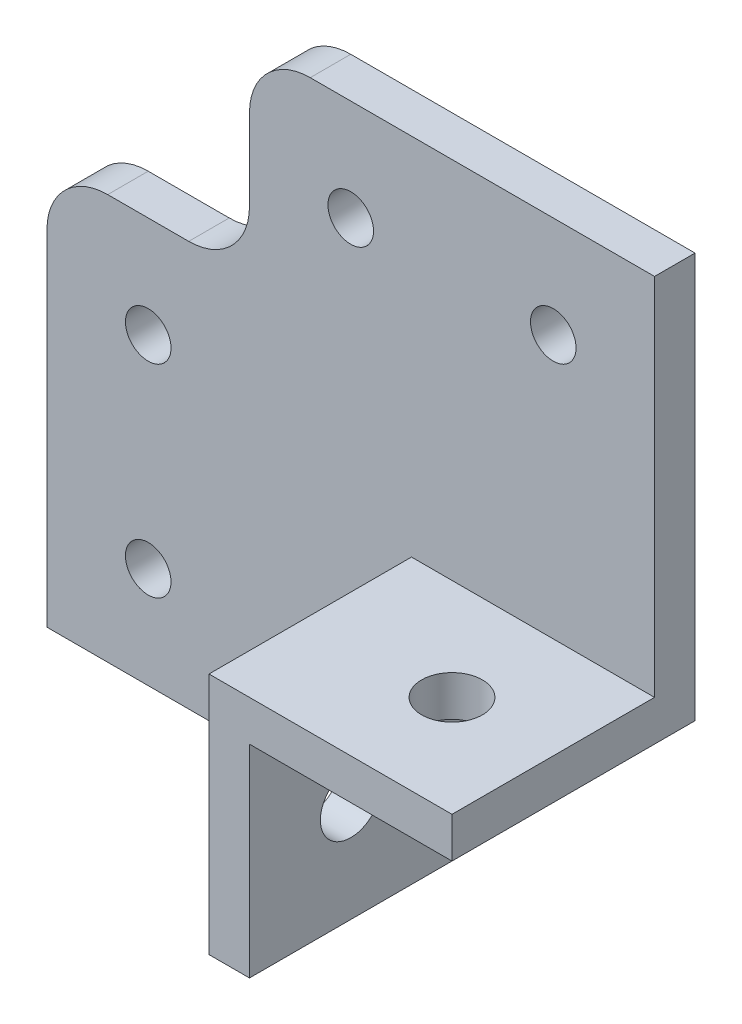
ISO-10303-21;
HEADER;
FILE_DESCRIPTION(('STEP AP214'),'2;1');
FILE_NAME('part.step','',(''),(''),'','','');
FILE_SCHEMA(('AUTOMOTIVE_DESIGN { 1 0 10303 214 1 1 1 1 }'));
ENDSEC;
DATA;
#1=APPLICATION_CONTEXT('core data for automotive mechanical design processes');
#2=APPLICATION_PROTOCOL_DEFINITION('international standard','automotive_design',2000,#1);
#3=PRODUCT_CONTEXT('',#1,'mechanical');
#4=PRODUCT('Part','Part','',(#3));
#5=PRODUCT_RELATED_PRODUCT_CATEGORY('part','',(#4));
#6=PRODUCT_DEFINITION_FORMATION('','',#4);
#7=PRODUCT_DEFINITION_CONTEXT('part definition',#1,'design');
#8=PRODUCT_DEFINITION('design','',#6,#7);
#9=PRODUCT_DEFINITION_SHAPE('','',#8);
#10=(LENGTH_UNIT() NAMED_UNIT(*) SI_UNIT(.MILLI.,.METRE.));
#11=(NAMED_UNIT(*) PLANE_ANGLE_UNIT() SI_UNIT($,.RADIAN.));
#12=(NAMED_UNIT(*) SI_UNIT($,.STERADIAN.) SOLID_ANGLE_UNIT());
#13=UNCERTAINTY_MEASURE_WITH_UNIT(LENGTH_MEASURE(1.E-05),#10,'distance_accuracy_value','');
#14=(GEOMETRIC_REPRESENTATION_CONTEXT(3) GLOBAL_UNCERTAINTY_ASSIGNED_CONTEXT((#13)) GLOBAL_UNIT_ASSIGNED_CONTEXT((#10,
#11,#12)) REPRESENTATION_CONTEXT('',''));
#15=CARTESIAN_POINT('',(0.,0.,0.));
#16=DIRECTION('',(0.,0.,1.));
#17=DIRECTION('',(1.,0.,0.));
#18=AXIS2_PLACEMENT_3D('',#15,#16,#17);
#19=CARTESIAN_POINT('',(20.,60.,4.));
#20=DIRECTION('',(0.,-1.,0.));
#21=DIRECTION('',(1.,0.,0.));
#22=AXIS2_PLACEMENT_3D('',#19,#20,#21);
#23=PLANE('',#22);
#24=DIRECTION('',(-1.,0.,0.));
#25=VECTOR('',#24,1.);
#26=CARTESIAN_POINT('',(20.,60.,0.));
#27=LINE('',#26,#25);
#28=CARTESIAN_POINT('',(20.,60.,0.));
#29=VERTEX_POINT('',#28);
#30=CARTESIAN_POINT('',(-14.,60.,0.));
#31=VERTEX_POINT('',#30);
#32=EDGE_CURVE('E229',#29,#31,#27,.T.);
#33=ORIENTED_EDGE('',*,*,#32,.T.);
#34=DIRECTION('',(0.,0.,-1.));
#35=VECTOR('',#34,1.);
#36=CARTESIAN_POINT('',(-14.,60.,4.));
#37=LINE('',#36,#35);
#38=CARTESIAN_POINT('',(-14.,60.,4.));
#39=VERTEX_POINT('',#38);
#40=EDGE_CURVE('E56',#31,#39,#37,.F.);
#41=ORIENTED_EDGE('',*,*,#40,.T.);
#42=DIRECTION('',(-1.,0.,0.));
#43=VECTOR('',#42,1.);
#44=CARTESIAN_POINT('',(20.,60.,4.));
#45=LINE('',#44,#43);
#46=CARTESIAN_POINT('',(20.,60.,4.));
#47=VERTEX_POINT('',#46);
#48=EDGE_CURVE('E244',#47,#39,#45,.T.);
#49=ORIENTED_EDGE('',*,*,#48,.F.);
#50=DIRECTION('',(0.,0.,-1.));
#51=VECTOR('',#50,1.);
#52=CARTESIAN_POINT('',(20.,60.,4.));
#53=LINE('',#52,#51);
#54=EDGE_CURVE('E147',#47,#29,#53,.T.);
#55=ORIENTED_EDGE('',*,*,#54,.T.);
#56=EDGE_LOOP('',(#33,#41,#49,#55));
#57=FACE_BOUND('',#56,.T.);
#58=ADVANCED_FACE('F33',(#57),#23,.F.);
#59=CARTESIAN_POINT('',(-20.,60.,4.));
#60=DIRECTION('',(1.,0.,0.));
#61=DIRECTION('',(0.,0.,-1.));
#62=AXIS2_PLACEMENT_3D('',#59,#60,#61);
#63=PLANE('',#62);
#64=DIRECTION('',(0.,-1.,0.));
#65=VECTOR('',#64,1.);
#66=CARTESIAN_POINT('',(-20.,60.,0.));
#67=LINE('',#66,#65);
#68=CARTESIAN_POINT('',(-20.,54.,0.));
#69=VERTEX_POINT('',#68);
#70=CARTESIAN_POINT('',(-20.,46.,0.));
#71=VERTEX_POINT('',#70);
#72=EDGE_CURVE('E218',#69,#71,#67,.T.);
#73=ORIENTED_EDGE('',*,*,#72,.T.);
#74=DIRECTION('',(0.,0.,-1.));
#75=VECTOR('',#74,1.);
#76=CARTESIAN_POINT('',(-20.,46.,4.));
#77=LINE('',#76,#75);
#78=CARTESIAN_POINT('',(-20.,46.,4.));
#79=VERTEX_POINT('',#78);
#80=EDGE_CURVE('E201',#71,#79,#77,.F.);
#81=ORIENTED_EDGE('',*,*,#80,.T.);
#82=DIRECTION('',(0.,-1.,0.));
#83=VECTOR('',#82,1.);
#84=CARTESIAN_POINT('',(-20.,60.,4.));
#85=LINE('',#84,#83);
#86=CARTESIAN_POINT('',(-20.,54.,4.));
#87=VERTEX_POINT('',#86);
#88=EDGE_CURVE('E236',#87,#79,#85,.T.);
#89=ORIENTED_EDGE('',*,*,#88,.F.);
#90=DIRECTION('',(0.,0.,-1.));
#91=VECTOR('',#90,1.);
#92=CARTESIAN_POINT('',(-20.,54.,4.));
#93=LINE('',#92,#91);
#94=EDGE_CURVE('E198',#87,#69,#93,.T.);
#95=ORIENTED_EDGE('',*,*,#94,.T.);
#96=EDGE_LOOP('',(#73,#81,#89,#95));
#97=FACE_BOUND('',#96,.T.);
#98=ADVANCED_FACE('F225',(#97),#63,.F.);
#99=CARTESIAN_POINT('',(-20.,40.,4.));
#100=DIRECTION('',(0.,-1.,0.));
#101=DIRECTION('',(1.,0.,0.));
#102=AXIS2_PLACEMENT_3D('',#99,#100,#101);
#103=PLANE('',#102);
#104=DIRECTION('',(-1.,0.,0.));
#105=VECTOR('',#104,1.);
#106=CARTESIAN_POINT('',(-20.,40.,4.));
#107=LINE('',#106,#105);
#108=CARTESIAN_POINT('',(-26.,40.,4.));
#109=VERTEX_POINT('',#108);
#110=CARTESIAN_POINT('',(-34.,40.,4.));
#111=VERTEX_POINT('',#110);
#112=EDGE_CURVE('E235',#109,#111,#107,.T.);
#113=ORIENTED_EDGE('',*,*,#112,.F.);
#114=DIRECTION('',(0.,0.,-1.));
#115=VECTOR('',#114,1.);
#116=CARTESIAN_POINT('',(-26.,40.,0.));
#117=LINE('',#116,#115);
#118=CARTESIAN_POINT('',(-26.,40.,0.));
#119=VERTEX_POINT('',#118);
#120=EDGE_CURVE('E194',#109,#119,#117,.T.);
#121=ORIENTED_EDGE('',*,*,#120,.T.);
#122=DIRECTION('',(-1.,0.,0.));
#123=VECTOR('',#122,1.);
#124=CARTESIAN_POINT('',(-20.,40.,0.));
#125=LINE('',#124,#123);
#126=CARTESIAN_POINT('',(-34.,40.,0.));
#127=VERTEX_POINT('',#126);
#128=EDGE_CURVE('E220',#119,#127,#125,.T.);
#129=ORIENTED_EDGE('',*,*,#128,.T.);
#130=DIRECTION('',(0.,0.,-1.));
#131=VECTOR('',#130,1.);
#132=CARTESIAN_POINT('',(-34.,40.,4.));
#133=LINE('',#132,#131);
#134=EDGE_CURVE('E192',#127,#111,#133,.F.);
#135=ORIENTED_EDGE('',*,*,#134,.T.);
#136=EDGE_LOOP('',(#113,#121,#129,#135));
#137=FACE_BOUND('',#136,.T.);
#138=ADVANCED_FACE('F238',(#137),#103,.F.);
#139=CARTESIAN_POINT('',(-40.,40.,4.));
#140=DIRECTION('',(1.,0.,0.));
#141=DIRECTION('',(0.,1.,0.));
#142=AXIS2_PLACEMENT_3D('',#139,#140,#141);
#143=PLANE('',#142);
#144=DIRECTION('',(0.,-1.,0.));
#145=VECTOR('',#144,1.);
#146=CARTESIAN_POINT('',(-40.,40.,4.));
#147=LINE('',#146,#145);
#148=CARTESIAN_POINT('',(-40.,34.,4.));
#149=VERTEX_POINT('',#148);
#150=CARTESIAN_POINT('',(-40.,0.,4.));
#151=VERTEX_POINT('',#150);
#152=EDGE_CURVE('E240',#149,#151,#147,.T.);
#153=ORIENTED_EDGE('',*,*,#152,.F.);
#154=DIRECTION('',(0.,0.,-1.));
#155=VECTOR('',#154,1.);
#156=CARTESIAN_POINT('',(-40.,34.,4.));
#157=LINE('',#156,#155);
#158=CARTESIAN_POINT('',(-40.,34.,0.));
#159=VERTEX_POINT('',#158);
#160=EDGE_CURVE('E211',#149,#159,#157,.T.);
#161=ORIENTED_EDGE('',*,*,#160,.T.);
#162=DIRECTION('',(0.,-1.,0.));
#163=VECTOR('',#162,1.);
#164=CARTESIAN_POINT('',(-40.,40.,0.));
#165=LINE('',#164,#163);
#166=CARTESIAN_POINT('',(-40.,0.,0.));
#167=VERTEX_POINT('',#166);
#168=EDGE_CURVE('E292',#159,#167,#165,.T.);
#169=ORIENTED_EDGE('',*,*,#168,.T.);
#170=DIRECTION('',(0.,0.,-1.));
#171=VECTOR('',#170,1.);
#172=CARTESIAN_POINT('',(-40.,0.,4.));
#173=LINE('',#172,#171);
#174=EDGE_CURVE('E195',#151,#167,#173,.T.);
#175=ORIENTED_EDGE('',*,*,#174,.F.);
#176=EDGE_LOOP('',(#153,#161,#169,#175));
#177=FACE_BOUND('',#176,.T.);
#178=ADVANCED_FACE('F298',(#177),#143,.F.);
#179=CARTESIAN_POINT('',(-40.,0.,4.));
#180=DIRECTION('',(0.,1.,0.));
#181=DIRECTION('',(0.,0.,1.));
#182=AXIS2_PLACEMENT_3D('',#179,#180,#181);
#183=PLANE('',#182);
#184=DIRECTION('',(1.,0.,0.));
#185=VECTOR('',#184,1.);
#186=CARTESIAN_POINT('',(-40.,0.,0.));
#187=LINE('',#186,#185);
#188=CARTESIAN_POINT('',(0.,0.,0.));
#189=VERTEX_POINT('',#188);
#190=EDGE_CURVE('E289',#167,#189,#187,.T.);
#191=ORIENTED_EDGE('',*,*,#190,.T.);
#192=DIRECTION('',(0.,0.,-1.));
#193=VECTOR('',#192,1.);
#194=CARTESIAN_POINT('',(0.,0.,4.));
#195=LINE('',#194,#193);
#196=CARTESIAN_POINT('',(0.,0.,24.));
#197=VERTEX_POINT('',#196);
#198=EDGE_CURVE('E279',#197,#189,#195,.T.);
#199=ORIENTED_EDGE('',*,*,#198,.F.);
#200=DIRECTION('',(1.,0.,0.));
#201=VECTOR('',#200,1.);
#202=CARTESIAN_POINT('',(-4.,0.,24.));
#203=LINE('',#202,#201);
#204=CARTESIAN_POINT('',(-4.,0.,24.));
#205=VERTEX_POINT('',#204);
#206=EDGE_CURVE('E176',#205,#197,#203,.T.);
#207=ORIENTED_EDGE('',*,*,#206,.F.);
#208=DIRECTION('',(0.,0.,-1.));
#209=VECTOR('',#208,1.);
#210=CARTESIAN_POINT('',(-4.,0.,24.));
#211=LINE('',#210,#209);
#212=CARTESIAN_POINT('',(-4.,0.,4.));
#213=VERTEX_POINT('',#212);
#214=EDGE_CURVE('E179',#205,#213,#211,.T.);
#215=ORIENTED_EDGE('',*,*,#214,.T.);
#216=DIRECTION('',(1.,0.,0.));
#217=VECTOR('',#216,1.);
#218=CARTESIAN_POINT('',(-40.,0.,4.));
#219=LINE('',#218,#217);
#220=EDGE_CURVE('E242',#151,#213,#219,.T.);
#221=ORIENTED_EDGE('',*,*,#220,.F.);
#222=ORIENTED_EDGE('',*,*,#174,.T.);
#223=EDGE_LOOP('',(#191,#199,#207,#215,#221,#222));
#224=FACE_BOUND('',#223,.T.);
#225=ADVANCED_FACE('F288',(#224),#183,.F.);
#226=CARTESIAN_POINT('',(0.,0.,4.));
#227=DIRECTION('',(-1.,0.,0.));
#228=DIRECTION('',(0.,0.,1.));
#229=AXIS2_PLACEMENT_3D('',#226,#227,#228);
#230=PLANE('',#229);
#231=CARTESIAN_POINT('',(0.,10.,14.));
#232=DIRECTION('',(-1.,0.,0.));
#233=DIRECTION('',(0.,0.,1.));
#234=AXIS2_PLACEMENT_3D('',#231,#232,#233);
#235=CIRCLE('',#234,3.);
#236=CARTESIAN_POINT('',(0.,10.,17.));
#237=VERTEX_POINT('',#236);
#238=EDGE_CURVE('E170',#237,#237,#235,.T.);
#239=ORIENTED_EDGE('',*,*,#238,.T.);
#240=EDGE_LOOP('',(#239));
#241=FACE_BOUND('',#240,.T.);
#242=DIRECTION('',(0.,1.,0.));
#243=VECTOR('',#242,1.);
#244=CARTESIAN_POINT('',(0.,0.,0.));
#245=LINE('',#244,#243);
#246=CARTESIAN_POINT('',(0.,20.,0.));
#247=VERTEX_POINT('',#246);
#248=EDGE_CURVE('E275',#189,#247,#245,.T.);
#249=ORIENTED_EDGE('',*,*,#248,.T.);
#250=DIRECTION('',(0.,0.,-1.));
#251=VECTOR('',#250,1.);
#252=CARTESIAN_POINT('',(0.,20.,4.));
#253=LINE('',#252,#251);
#254=CARTESIAN_POINT('',(0.,20.,24.));
#255=VERTEX_POINT('',#254);
#256=EDGE_CURVE('E146',#255,#247,#253,.T.);
#257=ORIENTED_EDGE('',*,*,#256,.F.);
#258=DIRECTION('',(0.,1.,0.));
#259=VECTOR('',#258,1.);
#260=CARTESIAN_POINT('',(0.,0.,24.));
#261=LINE('',#260,#259);
#262=EDGE_CURVE('E163',#197,#255,#261,.T.);
#263=ORIENTED_EDGE('',*,*,#262,.F.);
#264=ORIENTED_EDGE('',*,*,#198,.T.);
#265=EDGE_LOOP('',(#249,#257,#263,#264));
#266=FACE_BOUND('',#265,.T.);
#267=ADVANCED_FACE('F305',(#241,#266),#230,.F.);
#268=CARTESIAN_POINT('',(0.,20.,4.));
#269=DIRECTION('',(0.,1.,0.));
#270=DIRECTION('',(0.,0.,1.));
#271=AXIS2_PLACEMENT_3D('',#268,#269,#270);
#272=PLANE('',#271);
#273=CARTESIAN_POINT('',(10.,20.,14.));
#274=DIRECTION('',(0.,1.,0.));
#275=DIRECTION('',(0.,0.,1.));
#276=AXIS2_PLACEMENT_3D('',#273,#274,#275);
#277=CIRCLE('',#276,3.);
#278=CARTESIAN_POINT('',(10.,20.,17.));
#279=VERTEX_POINT('',#278);
#280=EDGE_CURVE('E511',#279,#279,#277,.T.);
#281=ORIENTED_EDGE('',*,*,#280,.T.);
#282=EDGE_LOOP('',(#281));
#283=FACE_BOUND('',#282,.T.);
#284=DIRECTION('',(1.,0.,0.));
#285=VECTOR('',#284,1.);
#286=CARTESIAN_POINT('',(0.,20.,0.));
#287=LINE('',#286,#285);
#288=CARTESIAN_POINT('',(20.,20.,0.));
#289=VERTEX_POINT('',#288);
#290=EDGE_CURVE('E143',#247,#289,#287,.T.);
#291=ORIENTED_EDGE('',*,*,#290,.T.);
#292=DIRECTION('',(0.,0.,-1.));
#293=VECTOR('',#292,1.);
#294=CARTESIAN_POINT('',(20.,20.,4.));
#295=LINE('',#294,#293);
#296=CARTESIAN_POINT('',(20.,20.,24.));
#297=VERTEX_POINT('',#296);
#298=EDGE_CURVE('E136',#297,#289,#295,.T.);
#299=ORIENTED_EDGE('',*,*,#298,.F.);
#300=DIRECTION('',(1.,0.,0.));
#301=VECTOR('',#300,1.);
#302=CARTESIAN_POINT('',(0.,20.,24.));
#303=LINE('',#302,#301);
#304=EDGE_CURVE('E141',#255,#297,#303,.T.);
#305=ORIENTED_EDGE('',*,*,#304,.F.);
#306=ORIENTED_EDGE('',*,*,#256,.T.);
#307=EDGE_LOOP('',(#291,#299,#305,#306));
#308=FACE_BOUND('',#307,.T.);
#309=ADVANCED_FACE('F138',(#283,#308),#272,.F.);
#310=CARTESIAN_POINT('',(20.,20.,4.));
#311=DIRECTION('',(-1.,0.,0.));
#312=DIRECTION('',(0.,0.,1.));
#313=AXIS2_PLACEMENT_3D('',#310,#311,#312);
#314=PLANE('',#313);
#315=DIRECTION('',(0.,1.,0.));
#316=VECTOR('',#315,1.);
#317=CARTESIAN_POINT('',(20.,20.,0.));
#318=LINE('',#317,#316);
#319=EDGE_CURVE('E270',#289,#29,#318,.T.);
#320=ORIENTED_EDGE('',*,*,#319,.T.);
#321=ORIENTED_EDGE('',*,*,#54,.F.);
#322=DIRECTION('',(0.,1.,0.));
#323=VECTOR('',#322,1.);
#324=CARTESIAN_POINT('',(20.,20.,4.));
#325=LINE('',#324,#323);
#326=CARTESIAN_POINT('',(20.,24.,4.));
#327=VERTEX_POINT('',#326);
#328=EDGE_CURVE('E254',#327,#47,#325,.T.);
#329=ORIENTED_EDGE('',*,*,#328,.F.);
#330=DIRECTION('',(0.,0.,-1.));
#331=VECTOR('',#330,1.);
#332=CARTESIAN_POINT('',(20.,24.,24.));
#333=LINE('',#332,#331);
#334=CARTESIAN_POINT('',(20.,24.,24.));
#335=VERTEX_POINT('',#334);
#336=EDGE_CURVE('E154',#335,#327,#333,.T.);
#337=ORIENTED_EDGE('',*,*,#336,.F.);
#338=DIRECTION('',(0.,1.,0.));
#339=VECTOR('',#338,1.);
#340=CARTESIAN_POINT('',(20.,20.,24.));
#341=LINE('',#340,#339);
#342=EDGE_CURVE('E150',#297,#335,#341,.T.);
#343=ORIENTED_EDGE('',*,*,#342,.F.);
#344=ORIENTED_EDGE('',*,*,#298,.T.);
#345=EDGE_LOOP('',(#320,#321,#329,#337,#343,#344));
#346=FACE_BOUND('',#345,.T.);
#347=ADVANCED_FACE('F151',(#346),#314,.F.);
#348=CARTESIAN_POINT('',(0.,0.,4.));
#349=DIRECTION('',(0.,0.,1.));
#350=DIRECTION('',(1.,0.,0.));
#351=AXIS2_PLACEMENT_3D('',#348,#349,#350);
#352=PLANE('',#351);
#353=CARTESIAN_POINT('',(-30.,10.,4.));
#354=DIRECTION('',(0.,0.,1.));
#355=DIRECTION('',(1.,0.,0.));
#356=AXIS2_PLACEMENT_3D('',#353,#354,#355);
#357=CIRCLE('',#356,2.25);
#358=CARTESIAN_POINT('',(-27.75,10.,4.));
#359=VERTEX_POINT('',#358);
#360=EDGE_CURVE('E538',#359,#359,#357,.T.);
#361=ORIENTED_EDGE('',*,*,#360,.F.);
#362=EDGE_LOOP('',(#361));
#363=FACE_BOUND('',#362,.T.);
#364=CARTESIAN_POINT('',(-30.,30.,4.));
#365=DIRECTION('',(0.,0.,1.));
#366=DIRECTION('',(1.,0.,0.));
#367=AXIS2_PLACEMENT_3D('',#364,#365,#366);
#368=CIRCLE('',#367,2.25);
#369=CARTESIAN_POINT('',(-27.75,30.,4.));
#370=VERTEX_POINT('',#369);
#371=EDGE_CURVE('E532',#370,#370,#368,.T.);
#372=ORIENTED_EDGE('',*,*,#371,.F.);
#373=EDGE_LOOP('',(#372));
#374=FACE_BOUND('',#373,.T.);
#375=CARTESIAN_POINT('',(-10.,50.,4.));
#376=DIRECTION('',(0.,0.,1.));
#377=DIRECTION('',(1.,0.,0.));
#378=AXIS2_PLACEMENT_3D('',#375,#376,#377);
#379=CIRCLE('',#378,2.25);
#380=CARTESIAN_POINT('',(-7.75,50.,4.));
#381=VERTEX_POINT('',#380);
#382=EDGE_CURVE('E526',#381,#381,#379,.T.);
#383=ORIENTED_EDGE('',*,*,#382,.F.);
#384=EDGE_LOOP('',(#383));
#385=FACE_BOUND('',#384,.T.);
#386=CARTESIAN_POINT('',(10.,50.,4.));
#387=DIRECTION('',(0.,0.,1.));
#388=DIRECTION('',(1.,0.,0.));
#389=AXIS2_PLACEMENT_3D('',#386,#387,#388);
#390=CIRCLE('',#389,2.25);
#391=CARTESIAN_POINT('',(12.25,50.,4.));
#392=VERTEX_POINT('',#391);
#393=EDGE_CURVE('E520',#392,#392,#390,.T.);
#394=ORIENTED_EDGE('',*,*,#393,.F.);
#395=EDGE_LOOP('',(#394));
#396=FACE_BOUND('',#395,.T.);
#397=ORIENTED_EDGE('',*,*,#48,.T.);
#398=CARTESIAN_POINT('',(-14.,54.,4.));
#399=DIRECTION('',(0.,0.,1.));
#400=DIRECTION('',(1.,0.,0.));
#401=AXIS2_PLACEMENT_3D('',#398,#399,#400);
#402=CIRCLE('',#401,6.);
#403=EDGE_CURVE('E209',#39,#87,#402,.T.);
#404=ORIENTED_EDGE('',*,*,#403,.T.);
#405=ORIENTED_EDGE('',*,*,#88,.T.);
#406=CARTESIAN_POINT('',(-26.,46.,4.));
#407=DIRECTION('',(0.,0.,1.));
#408=DIRECTION('',(1.,0.,0.));
#409=AXIS2_PLACEMENT_3D('',#406,#407,#408);
#410=CIRCLE('',#409,6.);
#411=EDGE_CURVE('E11',#79,#109,#410,.F.);
#412=ORIENTED_EDGE('',*,*,#411,.T.);
#413=ORIENTED_EDGE('',*,*,#112,.T.);
#414=CARTESIAN_POINT('',(-34.,34.,4.));
#415=DIRECTION('',(0.,0.,1.));
#416=DIRECTION('',(1.,0.,0.));
#417=AXIS2_PLACEMENT_3D('',#414,#415,#416);
#418=CIRCLE('',#417,6.);
#419=EDGE_CURVE('E48',#111,#149,#418,.T.);
#420=ORIENTED_EDGE('',*,*,#419,.T.);
#421=ORIENTED_EDGE('',*,*,#152,.T.);
#422=ORIENTED_EDGE('',*,*,#220,.T.);
#423=DIRECTION('',(0.,-1.,0.));
#424=VECTOR('',#423,1.);
#425=CARTESIAN_POINT('',(-4.,24.,4.));
#426=LINE('',#425,#424);
#427=CARTESIAN_POINT('',(-4.,24.,4.));
#428=VERTEX_POINT('',#427);
#429=EDGE_CURVE('E164',#428,#213,#426,.T.);
#430=ORIENTED_EDGE('',*,*,#429,.F.);
#431=DIRECTION('',(-1.,0.,0.));
#432=VECTOR('',#431,1.);
#433=CARTESIAN_POINT('',(20.,24.,4.));
#434=LINE('',#433,#432);
#435=EDGE_CURVE('E167',#327,#428,#434,.T.);
#436=ORIENTED_EDGE('',*,*,#435,.F.);
#437=ORIENTED_EDGE('',*,*,#328,.T.);
#438=EDGE_LOOP('',(#397,#404,#405,#412,#413,#420,#421,#422,#430,#436,#437));
#439=FACE_BOUND('',#438,.T.);
#440=ADVANCED_FACE('F234',(#363,#374,#385,#396,#439),#352,.T.);
#441=CARTESIAN_POINT('',(0.,0.,0.));
#442=DIRECTION('',(0.,0.,1.));
#443=DIRECTION('',(1.,0.,0.));
#444=AXIS2_PLACEMENT_3D('',#441,#442,#443);
#445=PLANE('',#444);
#446=CARTESIAN_POINT('',(-30.,10.,0.));
#447=DIRECTION('',(0.,0.,1.));
#448=DIRECTION('',(1.,0.,0.));
#449=AXIS2_PLACEMENT_3D('',#446,#447,#448);
#450=CIRCLE('',#449,2.25);
#451=CARTESIAN_POINT('',(-27.75,10.,0.));
#452=VERTEX_POINT('',#451);
#453=EDGE_CURVE('E535',#452,#452,#450,.T.);
#454=ORIENTED_EDGE('',*,*,#453,.T.);
#455=EDGE_LOOP('',(#454));
#456=FACE_BOUND('',#455,.T.);
#457=CARTESIAN_POINT('',(-30.,30.,0.));
#458=DIRECTION('',(0.,0.,1.));
#459=DIRECTION('',(1.,0.,0.));
#460=AXIS2_PLACEMENT_3D('',#457,#458,#459);
#461=CIRCLE('',#460,2.25);
#462=CARTESIAN_POINT('',(-27.75,30.,0.));
#463=VERTEX_POINT('',#462);
#464=EDGE_CURVE('E529',#463,#463,#461,.T.);
#465=ORIENTED_EDGE('',*,*,#464,.T.);
#466=EDGE_LOOP('',(#465));
#467=FACE_BOUND('',#466,.T.);
#468=CARTESIAN_POINT('',(-10.,50.,0.));
#469=DIRECTION('',(0.,0.,1.));
#470=DIRECTION('',(1.,0.,0.));
#471=AXIS2_PLACEMENT_3D('',#468,#469,#470);
#472=CIRCLE('',#471,2.25);
#473=CARTESIAN_POINT('',(-7.75,50.,0.));
#474=VERTEX_POINT('',#473);
#475=EDGE_CURVE('E523',#474,#474,#472,.T.);
#476=ORIENTED_EDGE('',*,*,#475,.T.);
#477=EDGE_LOOP('',(#476));
#478=FACE_BOUND('',#477,.T.);
#479=CARTESIAN_POINT('',(10.,50.,0.));
#480=DIRECTION('',(0.,0.,1.));
#481=DIRECTION('',(1.,0.,0.));
#482=AXIS2_PLACEMENT_3D('',#479,#480,#481);
#483=CIRCLE('',#482,2.25);
#484=CARTESIAN_POINT('',(12.25,50.,0.));
#485=VERTEX_POINT('',#484);
#486=EDGE_CURVE('E519',#485,#485,#483,.T.);
#487=ORIENTED_EDGE('',*,*,#486,.T.);
#488=EDGE_LOOP('',(#487));
#489=FACE_BOUND('',#488,.T.);
#490=ORIENTED_EDGE('',*,*,#72,.F.);
#491=CARTESIAN_POINT('',(-14.,54.,0.));
#492=DIRECTION('',(0.,0.,1.));
#493=DIRECTION('',(1.,0.,0.));
#494=AXIS2_PLACEMENT_3D('',#491,#492,#493);
#495=CIRCLE('',#494,6.);
#496=EDGE_CURVE('E205',#69,#31,#495,.F.);
#497=ORIENTED_EDGE('',*,*,#496,.T.);
#498=ORIENTED_EDGE('',*,*,#32,.F.);
#499=ORIENTED_EDGE('',*,*,#319,.F.);
#500=ORIENTED_EDGE('',*,*,#290,.F.);
#501=ORIENTED_EDGE('',*,*,#248,.F.);
#502=ORIENTED_EDGE('',*,*,#190,.F.);
#503=ORIENTED_EDGE('',*,*,#168,.F.);
#504=CARTESIAN_POINT('',(-34.,34.,0.));
#505=DIRECTION('',(0.,0.,1.));
#506=DIRECTION('',(1.,0.,0.));
#507=AXIS2_PLACEMENT_3D('',#504,#505,#506);
#508=CIRCLE('',#507,6.);
#509=EDGE_CURVE('E203',#159,#127,#508,.F.);
#510=ORIENTED_EDGE('',*,*,#509,.T.);
#511=ORIENTED_EDGE('',*,*,#128,.F.);
#512=CARTESIAN_POINT('',(-26.,46.,0.));
#513=DIRECTION('',(0.,0.,1.));
#514=DIRECTION('',(1.,0.,0.));
#515=AXIS2_PLACEMENT_3D('',#512,#513,#514);
#516=CIRCLE('',#515,6.);
#517=EDGE_CURVE('E41',#119,#71,#516,.T.);
#518=ORIENTED_EDGE('',*,*,#517,.T.);
#519=EDGE_LOOP('',(#490,#497,#498,#499,#500,#501,#502,#503,#510,#511,#518));
#520=FACE_BOUND('',#519,.T.);
#521=ADVANCED_FACE('F217',(#456,#467,#478,#489,#520),#445,.F.);
#522=CARTESIAN_POINT('',(20.,24.,24.));
#523=DIRECTION('',(0.,-1.,0.));
#524=DIRECTION('',(1.,0.,0.));
#525=AXIS2_PLACEMENT_3D('',#522,#523,#524);
#526=PLANE('',#525);
#527=CARTESIAN_POINT('',(10.,24.,14.));
#528=DIRECTION('',(0.,1.,0.));
#529=DIRECTION('',(-1.,0.,0.));
#530=AXIS2_PLACEMENT_3D('',#527,#528,#529);
#531=CIRCLE('',#530,3.);
#532=CARTESIAN_POINT('',(7.,24.,14.));
#533=VERTEX_POINT('',#532);
#534=EDGE_CURVE('E514',#533,#533,#531,.T.);
#535=ORIENTED_EDGE('',*,*,#534,.F.);
#536=EDGE_LOOP('',(#535));
#537=FACE_BOUND('',#536,.T.);
#538=ORIENTED_EDGE('',*,*,#435,.T.);
#539=DIRECTION('',(0.,0.,-1.));
#540=VECTOR('',#539,1.);
#541=CARTESIAN_POINT('',(-4.,24.,24.));
#542=LINE('',#541,#540);
#543=CARTESIAN_POINT('',(-4.,24.,24.));
#544=VERTEX_POINT('',#543);
#545=EDGE_CURVE('E182',#544,#428,#542,.T.);
#546=ORIENTED_EDGE('',*,*,#545,.F.);
#547=DIRECTION('',(-1.,0.,0.));
#548=VECTOR('',#547,1.);
#549=CARTESIAN_POINT('',(20.,24.,24.));
#550=LINE('',#549,#548);
#551=EDGE_CURVE('E157',#335,#544,#550,.T.);
#552=ORIENTED_EDGE('',*,*,#551,.F.);
#553=ORIENTED_EDGE('',*,*,#336,.T.);
#554=EDGE_LOOP('',(#538,#546,#552,#553));
#555=FACE_BOUND('',#554,.T.);
#556=ADVANCED_FACE('F267',(#537,#555),#526,.F.);
#557=CARTESIAN_POINT('',(-4.,24.,24.));
#558=DIRECTION('',(1.,0.,0.));
#559=DIRECTION('',(0.,1.,0.));
#560=AXIS2_PLACEMENT_3D('',#557,#558,#559);
#561=PLANE('',#560);
#562=CARTESIAN_POINT('',(-4.,10.,14.));
#563=DIRECTION('',(-1.,0.,0.));
#564=DIRECTION('',(0.,-1.,0.));
#565=AXIS2_PLACEMENT_3D('',#562,#563,#564);
#566=CIRCLE('',#565,3.);
#567=CARTESIAN_POINT('',(-4.,7.,14.));
#568=VERTEX_POINT('',#567);
#569=EDGE_CURVE('E509',#568,#568,#566,.T.);
#570=ORIENTED_EDGE('',*,*,#569,.F.);
#571=EDGE_LOOP('',(#570));
#572=FACE_BOUND('',#571,.T.);
#573=ORIENTED_EDGE('',*,*,#429,.T.);
#574=ORIENTED_EDGE('',*,*,#214,.F.);
#575=DIRECTION('',(0.,-1.,0.));
#576=VECTOR('',#575,1.);
#577=CARTESIAN_POINT('',(-4.,24.,24.));
#578=LINE('',#577,#576);
#579=EDGE_CURVE('E174',#544,#205,#578,.T.);
#580=ORIENTED_EDGE('',*,*,#579,.F.);
#581=ORIENTED_EDGE('',*,*,#545,.T.);
#582=EDGE_LOOP('',(#573,#574,#580,#581));
#583=FACE_BOUND('',#582,.T.);
#584=ADVANCED_FACE('F265',(#572,#583),#561,.F.);
#585=CARTESIAN_POINT('',(0.,0.,24.));
#586=DIRECTION('',(0.,0.,1.));
#587=DIRECTION('',(1.,0.,0.));
#588=AXIS2_PLACEMENT_3D('',#585,#586,#587);
#589=PLANE('',#588);
#590=ORIENTED_EDGE('',*,*,#304,.T.);
#591=ORIENTED_EDGE('',*,*,#342,.T.);
#592=ORIENTED_EDGE('',*,*,#551,.T.);
#593=ORIENTED_EDGE('',*,*,#579,.T.);
#594=ORIENTED_EDGE('',*,*,#206,.T.);
#595=ORIENTED_EDGE('',*,*,#262,.T.);
#596=EDGE_LOOP('',(#590,#591,#592,#593,#594,#595));
#597=FACE_BOUND('',#596,.T.);
#598=ADVANCED_FACE('F160',(#597),#589,.T.);
#599=CARTESIAN_POINT('',(20.00005,10.,14.));
#600=DIRECTION('',(-1.,0.,0.));
#601=DIRECTION('',(0.,-1.,0.));
#602=AXIS2_PLACEMENT_3D('',#599,#600,#601);
#603=CYLINDRICAL_SURFACE('',#602,3.);
#604=ORIENTED_EDGE('',*,*,#569,.T.);
#605=EDGE_LOOP('',(#604));
#606=FACE_BOUND('',#605,.T.);
#607=ORIENTED_EDGE('',*,*,#238,.F.);
#608=EDGE_LOOP('',(#607));
#609=FACE_BOUND('',#608,.T.);
#610=ADVANCED_FACE('F427',(#606,#609),#603,.F.);
#611=CARTESIAN_POINT('',(10.,-5.00000000049072E-05,14.));
#612=DIRECTION('',(0.,1.,0.));
#613=DIRECTION('',(-1.,0.,0.));
#614=AXIS2_PLACEMENT_3D('',#611,#612,#613);
#615=CYLINDRICAL_SURFACE('',#614,3.);
#616=ORIENTED_EDGE('',*,*,#534,.T.);
#617=EDGE_LOOP('',(#616));
#618=FACE_BOUND('',#617,.T.);
#619=ORIENTED_EDGE('',*,*,#280,.F.);
#620=EDGE_LOOP('',(#619));
#621=FACE_BOUND('',#620,.T.);
#622=ADVANCED_FACE('F417',(#618,#621),#615,.F.);
#623=CARTESIAN_POINT('',(10.,50.,0.));
#624=DIRECTION('',(0.,0.,1.));
#625=DIRECTION('',(1.,0.,0.));
#626=AXIS2_PLACEMENT_3D('',#623,#624,#625);
#627=CYLINDRICAL_SURFACE('',#626,2.25);
#628=ORIENTED_EDGE('',*,*,#486,.F.);
#629=EDGE_LOOP('',(#628));
#630=FACE_BOUND('',#629,.T.);
#631=ORIENTED_EDGE('',*,*,#393,.T.);
#632=EDGE_LOOP('',(#631));
#633=FACE_BOUND('',#632,.T.);
#634=ADVANCED_FACE('F407',(#630,#633),#627,.F.);
#635=CARTESIAN_POINT('',(-10.,50.,0.));
#636=DIRECTION('',(0.,0.,1.));
#637=DIRECTION('',(1.,0.,0.));
#638=AXIS2_PLACEMENT_3D('',#635,#636,#637);
#639=CYLINDRICAL_SURFACE('',#638,2.25);
#640=ORIENTED_EDGE('',*,*,#475,.F.);
#641=EDGE_LOOP('',(#640));
#642=FACE_BOUND('',#641,.T.);
#643=ORIENTED_EDGE('',*,*,#382,.T.);
#644=EDGE_LOOP('',(#643));
#645=FACE_BOUND('',#644,.T.);
#646=ADVANCED_FACE('F397',(#642,#645),#639,.F.);
#647=CARTESIAN_POINT('',(-30.,30.,0.));
#648=DIRECTION('',(0.,0.,1.));
#649=DIRECTION('',(1.,0.,0.));
#650=AXIS2_PLACEMENT_3D('',#647,#648,#649);
#651=CYLINDRICAL_SURFACE('',#650,2.25);
#652=ORIENTED_EDGE('',*,*,#464,.F.);
#653=EDGE_LOOP('',(#652));
#654=FACE_BOUND('',#653,.T.);
#655=ORIENTED_EDGE('',*,*,#371,.T.);
#656=EDGE_LOOP('',(#655));
#657=FACE_BOUND('',#656,.T.);
#658=ADVANCED_FACE('F387',(#654,#657),#651,.F.);
#659=CARTESIAN_POINT('',(-30.,10.,0.));
#660=DIRECTION('',(0.,0.,1.));
#661=DIRECTION('',(1.,0.,0.));
#662=AXIS2_PLACEMENT_3D('',#659,#660,#661);
#663=CYLINDRICAL_SURFACE('',#662,2.25);
#664=ORIENTED_EDGE('',*,*,#453,.F.);
#665=EDGE_LOOP('',(#664));
#666=FACE_BOUND('',#665,.T.);
#667=ORIENTED_EDGE('',*,*,#360,.T.);
#668=EDGE_LOOP('',(#667));
#669=FACE_BOUND('',#668,.T.);
#670=ADVANCED_FACE('F317',(#666,#669),#663,.F.);
#671=CARTESIAN_POINT('',(-26.,46.,4.));
#672=DIRECTION('',(0.,0.,1.));
#673=DIRECTION('',(1.,0.,0.));
#674=AXIS2_PLACEMENT_3D('',#671,#672,#673);
#675=CYLINDRICAL_SURFACE('',#674,6.);
#676=ORIENTED_EDGE('',*,*,#411,.F.);
#677=ORIENTED_EDGE('',*,*,#80,.F.);
#678=ORIENTED_EDGE('',*,*,#517,.F.);
#679=ORIENTED_EDGE('',*,*,#120,.F.);
#680=EDGE_LOOP('',(#676,#677,#678,#679));
#681=FACE_BOUND('',#680,.T.);
#682=ADVANCED_FACE('F232',(#681),#675,.F.);
#683=CARTESIAN_POINT('',(-14.,54.,4.));
#684=DIRECTION('',(0.,0.,-1.));
#685=DIRECTION('',(-1.,0.,0.));
#686=AXIS2_PLACEMENT_3D('',#683,#684,#685);
#687=CYLINDRICAL_SURFACE('',#686,6.);
#688=ORIENTED_EDGE('',*,*,#403,.F.);
#689=ORIENTED_EDGE('',*,*,#40,.F.);
#690=ORIENTED_EDGE('',*,*,#496,.F.);
#691=ORIENTED_EDGE('',*,*,#94,.F.);
#692=EDGE_LOOP('',(#688,#689,#690,#691));
#693=FACE_BOUND('',#692,.T.);
#694=ADVANCED_FACE('F316',(#693),#687,.T.);
#695=CARTESIAN_POINT('',(-34.,34.,4.));
#696=DIRECTION('',(0.,0.,-1.));
#697=DIRECTION('',(-1.,0.,0.));
#698=AXIS2_PLACEMENT_3D('',#695,#696,#697);
#699=CYLINDRICAL_SURFACE('',#698,6.);
#700=ORIENTED_EDGE('',*,*,#419,.F.);
#701=ORIENTED_EDGE('',*,*,#134,.F.);
#702=ORIENTED_EDGE('',*,*,#509,.F.);
#703=ORIENTED_EDGE('',*,*,#160,.F.);
#704=EDGE_LOOP('',(#700,#701,#702,#703));
#705=FACE_BOUND('',#704,.T.);
#706=ADVANCED_FACE('F35',(#705),#699,.T.);
#707=CLOSED_SHELL('',(#58,#98,#138,#178,#225,#267,#309,#347,#440,#521,#556,#584,#598,#610,#622,
#634,#646,#658,#670,#682,#694,#706));
#708=MANIFOLD_SOLID_BREP('B2',#707);
#709=ADVANCED_BREP_SHAPE_REPRESENTATION('',(#18,#708),#14);
#710=SHAPE_DEFINITION_REPRESENTATION(#9,#709);
ENDSEC;
END-ISO-10303-21;
